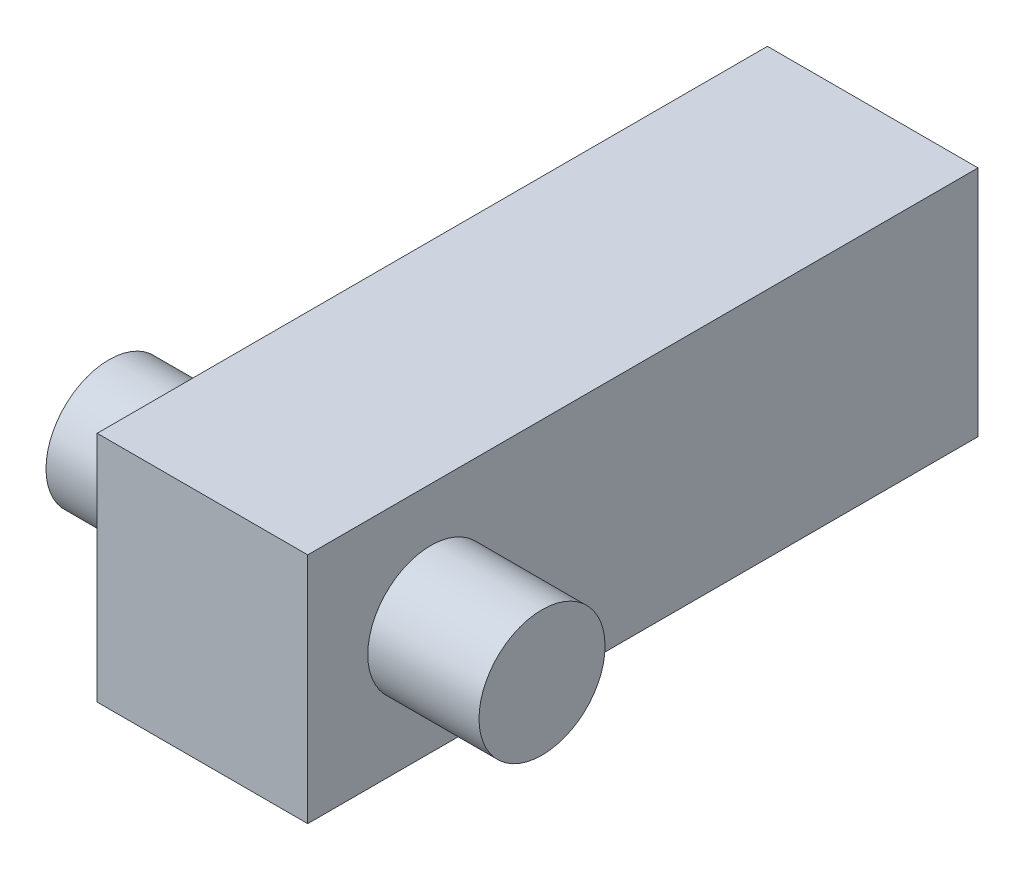
ISO-10303-21;
HEADER;
FILE_DESCRIPTION(('STEP AP214'),'2;1');
FILE_NAME('part.step','',(''),(''),'','','');
FILE_SCHEMA(('AUTOMOTIVE_DESIGN { 1 0 10303 214 1 1 1 1 }'));
ENDSEC;
DATA;
#1=APPLICATION_CONTEXT('core data for automotive mechanical design processes');
#2=APPLICATION_PROTOCOL_DEFINITION('international standard','automotive_design',2000,#1);
#3=PRODUCT_CONTEXT('',#1,'mechanical');
#4=PRODUCT('Part','Part','',(#3));
#5=PRODUCT_RELATED_PRODUCT_CATEGORY('part','',(#4));
#6=PRODUCT_DEFINITION_FORMATION('','',#4);
#7=PRODUCT_DEFINITION_CONTEXT('part definition',#1,'design');
#8=PRODUCT_DEFINITION('design','',#6,#7);
#9=PRODUCT_DEFINITION_SHAPE('','',#8);
#10=(LENGTH_UNIT() NAMED_UNIT(*) SI_UNIT(.MILLI.,.METRE.));
#11=(NAMED_UNIT(*) PLANE_ANGLE_UNIT() SI_UNIT($,.RADIAN.));
#12=(NAMED_UNIT(*) SI_UNIT($,.STERADIAN.) SOLID_ANGLE_UNIT());
#13=UNCERTAINTY_MEASURE_WITH_UNIT(LENGTH_MEASURE(1.E-05),#10,'distance_accuracy_value','');
#14=(GEOMETRIC_REPRESENTATION_CONTEXT(3) GLOBAL_UNCERTAINTY_ASSIGNED_CONTEXT((#13)) GLOBAL_UNIT_ASSIGNED_CONTEXT((#10,
#11,#12)) REPRESENTATION_CONTEXT('',''));
#15=CARTESIAN_POINT('',(0.,0.,0.));
#16=DIRECTION('',(0.,0.,1.));
#17=DIRECTION('',(1.,0.,0.));
#18=AXIS2_PLACEMENT_3D('',#15,#16,#17);
#19=CARTESIAN_POINT('',(0.,39.878,0.));
#20=DIRECTION('',(1.,0.,0.));
#21=DIRECTION('',(0.,0.,-1.));
#22=AXIS2_PLACEMENT_3D('',#19,#20,#21);
#23=PLANE('',#22);
#24=CARTESIAN_POINT('',(0.,19.939,-21.082));
#25=DIRECTION('',(1.,0.,0.));
#26=DIRECTION('',(0.,0.,-1.));
#27=AXIS2_PLACEMENT_3D('',#24,#25,#26);
#28=CIRCLE('',#27,10.795);
#29=CARTESIAN_POINT('',(0.,19.939,-31.877));
#30=VERTEX_POINT('',#29);
#31=EDGE_CURVE('E41',#30,#30,#28,.F.);
#32=ORIENTED_EDGE('',*,*,#31,.F.);
#33=EDGE_LOOP('',(#32));
#34=FACE_BOUND('',#33,.T.);
#35=DIRECTION('',(0.,0.,1.));
#36=VECTOR('',#35,1.);
#37=CARTESIAN_POINT('',(0.,0.,0.));
#38=LINE('',#37,#36);
#39=CARTESIAN_POINT('',(0.,0.,-114.808));
#40=VERTEX_POINT('',#39);
#41=CARTESIAN_POINT('',(0.,0.,0.));
#42=VERTEX_POINT('',#41);
#43=EDGE_CURVE('E100',#40,#42,#38,.T.);
#44=ORIENTED_EDGE('',*,*,#43,.T.);
#45=DIRECTION('',(0.,-1.,0.));
#46=VECTOR('',#45,1.);
#47=CARTESIAN_POINT('',(0.,39.878,0.));
#48=LINE('',#47,#46);
#49=CARTESIAN_POINT('',(0.,39.878,0.));
#50=VERTEX_POINT('',#49);
#51=EDGE_CURVE('E91',#50,#42,#48,.T.);
#52=ORIENTED_EDGE('',*,*,#51,.F.);
#53=DIRECTION('',(0.,0.,1.));
#54=VECTOR('',#53,1.);
#55=CARTESIAN_POINT('',(0.,39.878,0.));
#56=LINE('',#55,#54);
#57=CARTESIAN_POINT('',(0.,39.878,-114.808));
#58=VERTEX_POINT('',#57);
#59=EDGE_CURVE('E85',#58,#50,#56,.T.);
#60=ORIENTED_EDGE('',*,*,#59,.F.);
#61=DIRECTION('',(0.,-1.,0.));
#62=VECTOR('',#61,1.);
#63=CARTESIAN_POINT('',(0.,39.878,-114.808));
#64=LINE('',#63,#62);
#65=EDGE_CURVE('E96',#58,#40,#64,.T.);
#66=ORIENTED_EDGE('',*,*,#65,.T.);
#67=EDGE_LOOP('',(#44,#52,#60,#66));
#68=FACE_BOUND('',#67,.T.);
#69=ADVANCED_FACE('F33',(#34,#68),#23,.F.);
#70=CARTESIAN_POINT('',(0.,39.878,0.));
#71=DIRECTION('',(0.,0.,-1.));
#72=DIRECTION('',(-1.,0.,0.));
#73=AXIS2_PLACEMENT_3D('',#70,#71,#72);
#74=PLANE('',#73);
#75=DIRECTION('',(1.,0.,0.));
#76=VECTOR('',#75,1.);
#77=CARTESIAN_POINT('',(0.,0.,0.));
#78=LINE('',#77,#76);
#79=CARTESIAN_POINT('',(36.068,0.,0.));
#80=VERTEX_POINT('',#79);
#81=EDGE_CURVE('E90',#42,#80,#78,.T.);
#82=ORIENTED_EDGE('',*,*,#81,.T.);
#83=DIRECTION('',(0.,-1.,0.));
#84=VECTOR('',#83,1.);
#85=CARTESIAN_POINT('',(36.068,39.878,0.));
#86=LINE('',#85,#84);
#87=CARTESIAN_POINT('',(36.068,39.878,0.));
#88=VERTEX_POINT('',#87);
#89=EDGE_CURVE('E88',#88,#80,#86,.T.);
#90=ORIENTED_EDGE('',*,*,#89,.F.);
#91=DIRECTION('',(1.,0.,0.));
#92=VECTOR('',#91,1.);
#93=CARTESIAN_POINT('',(0.,39.878,0.));
#94=LINE('',#93,#92);
#95=EDGE_CURVE('E80',#50,#88,#94,.T.);
#96=ORIENTED_EDGE('',*,*,#95,.F.);
#97=ORIENTED_EDGE('',*,*,#51,.T.);
#98=EDGE_LOOP('',(#82,#90,#96,#97));
#99=FACE_BOUND('',#98,.T.);
#100=ADVANCED_FACE('F89',(#99),#74,.F.);
#101=CARTESIAN_POINT('',(36.068,39.878,0.));
#102=DIRECTION('',(-1.,0.,0.));
#103=DIRECTION('',(0.,0.,1.));
#104=AXIS2_PLACEMENT_3D('',#101,#102,#103);
#105=PLANE('',#104);
#106=CARTESIAN_POINT('',(36.068,19.939,-21.082));
#107=DIRECTION('',(-1.,0.,0.));
#108=DIRECTION('',(0.,0.,1.));
#109=AXIS2_PLACEMENT_3D('',#106,#107,#108);
#110=CIRCLE('',#109,10.795);
#111=CARTESIAN_POINT('',(36.068,19.939,-10.287));
#112=VERTEX_POINT('',#111);
#113=EDGE_CURVE('E11',#112,#112,#110,.F.);
#114=ORIENTED_EDGE('',*,*,#113,.F.);
#115=EDGE_LOOP('',(#114));
#116=FACE_BOUND('',#115,.T.);
#117=DIRECTION('',(0.,0.,-1.));
#118=VECTOR('',#117,1.);
#119=CARTESIAN_POINT('',(36.068,0.,0.));
#120=LINE('',#119,#118);
#121=CARTESIAN_POINT('',(36.068,0.,-114.808));
#122=VERTEX_POINT('',#121);
#123=EDGE_CURVE('E66',#80,#122,#120,.T.);
#124=ORIENTED_EDGE('',*,*,#123,.T.);
#125=DIRECTION('',(0.,-1.,0.));
#126=VECTOR('',#125,1.);
#127=CARTESIAN_POINT('',(36.068,39.878,-114.808));
#128=LINE('',#127,#126);
#129=CARTESIAN_POINT('',(36.068,39.878,-114.808));
#130=VERTEX_POINT('',#129);
#131=EDGE_CURVE('E92',#130,#122,#128,.T.);
#132=ORIENTED_EDGE('',*,*,#131,.F.);
#133=DIRECTION('',(0.,0.,-1.));
#134=VECTOR('',#133,1.);
#135=CARTESIAN_POINT('',(36.068,39.878,0.));
#136=LINE('',#135,#134);
#137=EDGE_CURVE('E83',#88,#130,#136,.T.);
#138=ORIENTED_EDGE('',*,*,#137,.F.);
#139=ORIENTED_EDGE('',*,*,#89,.T.);
#140=EDGE_LOOP('',(#124,#132,#138,#139));
#141=FACE_BOUND('',#140,.T.);
#142=ADVANCED_FACE('F94',(#116,#141),#105,.F.);
#143=CARTESIAN_POINT('',(0.,39.878,-114.808));
#144=DIRECTION('',(0.,0.,1.));
#145=DIRECTION('',(1.,0.,0.));
#146=AXIS2_PLACEMENT_3D('',#143,#144,#145);
#147=PLANE('',#146);
#148=DIRECTION('',(-1.,0.,0.));
#149=VECTOR('',#148,1.);
#150=CARTESIAN_POINT('',(0.,0.,-114.808));
#151=LINE('',#150,#149);
#152=EDGE_CURVE('E72',#122,#40,#151,.T.);
#153=ORIENTED_EDGE('',*,*,#152,.T.);
#154=ORIENTED_EDGE('',*,*,#65,.F.);
#155=DIRECTION('',(-1.,0.,0.));
#156=VECTOR('',#155,1.);
#157=CARTESIAN_POINT('',(0.,39.878,-114.808));
#158=LINE('',#157,#156);
#159=EDGE_CURVE('E49',#130,#58,#158,.T.);
#160=ORIENTED_EDGE('',*,*,#159,.F.);
#161=ORIENTED_EDGE('',*,*,#131,.T.);
#162=EDGE_LOOP('',(#153,#154,#160,#161));
#163=FACE_BOUND('',#162,.T.);
#164=ADVANCED_FACE('F128',(#163),#147,.F.);
#165=CARTESIAN_POINT('',(0.,39.878,0.));
#166=DIRECTION('',(0.,-1.,0.));
#167=DIRECTION('',(0.,0.,-1.));
#168=AXIS2_PLACEMENT_3D('',#165,#166,#167);
#169=PLANE('',#168);
#170=ORIENTED_EDGE('',*,*,#59,.T.);
#171=ORIENTED_EDGE('',*,*,#95,.T.);
#172=ORIENTED_EDGE('',*,*,#137,.T.);
#173=ORIENTED_EDGE('',*,*,#159,.T.);
#174=EDGE_LOOP('',(#170,#171,#172,#173));
#175=FACE_BOUND('',#174,.T.);
#176=ADVANCED_FACE('F81',(#175),#169,.F.);
#177=CARTESIAN_POINT('',(0.,0.,0.));
#178=DIRECTION('',(0.,-1.,0.));
#179=DIRECTION('',(0.,0.,-1.));
#180=AXIS2_PLACEMENT_3D('',#177,#178,#179);
#181=PLANE('',#180);
#182=ORIENTED_EDGE('',*,*,#43,.F.);
#183=ORIENTED_EDGE('',*,*,#152,.F.);
#184=ORIENTED_EDGE('',*,*,#123,.F.);
#185=ORIENTED_EDGE('',*,*,#81,.F.);
#186=EDGE_LOOP('',(#182,#183,#184,#185));
#187=FACE_BOUND('',#186,.T.);
#188=ADVANCED_FACE('F118',(#187),#181,.T.);
#189=CARTESIAN_POINT('',(-19.05,19.939,-21.082));
#190=DIRECTION('',(1.,0.,0.));
#191=DIRECTION('',(0.,0.,-1.));
#192=AXIS2_PLACEMENT_3D('',#189,#190,#191);
#193=CYLINDRICAL_SURFACE('',#192,10.795);
#194=CARTESIAN_POINT('',(-19.05,19.939,-21.082));
#195=DIRECTION('',(-1.,0.,0.));
#196=DIRECTION('',(0.,0.,1.));
#197=AXIS2_PLACEMENT_3D('',#194,#195,#196);
#198=CIRCLE('',#197,10.795);
#199=CARTESIAN_POINT('',(-19.05,19.939,-10.287));
#200=VERTEX_POINT('',#199);
#201=EDGE_CURVE('E103',#200,#200,#198,.T.);
#202=ORIENTED_EDGE('',*,*,#201,.F.);
#203=EDGE_LOOP('',(#202));
#204=FACE_BOUND('',#203,.T.);
#205=ORIENTED_EDGE('',*,*,#31,.T.);
#206=EDGE_LOOP('',(#205));
#207=FACE_BOUND('',#206,.T.);
#208=ADVANCED_FACE('F112',(#204,#207),#193,.T.);
#209=CARTESIAN_POINT('',(-19.05,19.939,-21.082));
#210=DIRECTION('',(-1.,0.,0.));
#211=DIRECTION('',(0.,0.,1.));
#212=AXIS2_PLACEMENT_3D('',#209,#210,#211);
#213=PLANE('',#212);
#214=ORIENTED_EDGE('',*,*,#201,.T.);
#215=EDGE_LOOP('',(#214));
#216=FACE_BOUND('',#215,.T.);
#217=ADVANCED_FACE('F125',(#216),#213,.T.);
#218=CARTESIAN_POINT('',(55.118,19.939,-21.082));
#219=DIRECTION('',(-1.,0.,0.));
#220=DIRECTION('',(0.,0.,1.));
#221=AXIS2_PLACEMENT_3D('',#218,#219,#220);
#222=CYLINDRICAL_SURFACE('',#221,10.795);
#223=CARTESIAN_POINT('',(55.118,19.939,-21.082));
#224=DIRECTION('',(1.,0.,0.));
#225=DIRECTION('',(0.,0.,-1.));
#226=AXIS2_PLACEMENT_3D('',#223,#224,#225);
#227=CIRCLE('',#226,10.795);
#228=CARTESIAN_POINT('',(55.118,19.939,-31.877));
#229=VERTEX_POINT('',#228);
#230=EDGE_CURVE('E201',#229,#229,#227,.T.);
#231=ORIENTED_EDGE('',*,*,#230,.F.);
#232=EDGE_LOOP('',(#231));
#233=FACE_BOUND('',#232,.T.);
#234=ORIENTED_EDGE('',*,*,#113,.T.);
#235=EDGE_LOOP('',(#234));
#236=FACE_BOUND('',#235,.T.);
#237=ADVANCED_FACE('F175',(#233,#236),#222,.T.);
#238=CARTESIAN_POINT('',(55.118,19.939,-21.082));
#239=DIRECTION('',(1.,0.,0.));
#240=DIRECTION('',(0.,0.,-1.));
#241=AXIS2_PLACEMENT_3D('',#238,#239,#240);
#242=PLANE('',#241);
#243=ORIENTED_EDGE('',*,*,#230,.T.);
#244=EDGE_LOOP('',(#243));
#245=FACE_BOUND('',#244,.T.);
#246=ADVANCED_FACE('F185',(#245),#242,.T.);
#247=CLOSED_SHELL('',(#69,#100,#142,#164,#176,#188,#208,#217,#237,#246));
#248=MANIFOLD_SOLID_BREP('B2',#247);
#249=ADVANCED_BREP_SHAPE_REPRESENTATION('',(#18,#248),#14);
#250=SHAPE_DEFINITION_REPRESENTATION(#9,#249);
ENDSEC;
END-ISO-10303-21;
